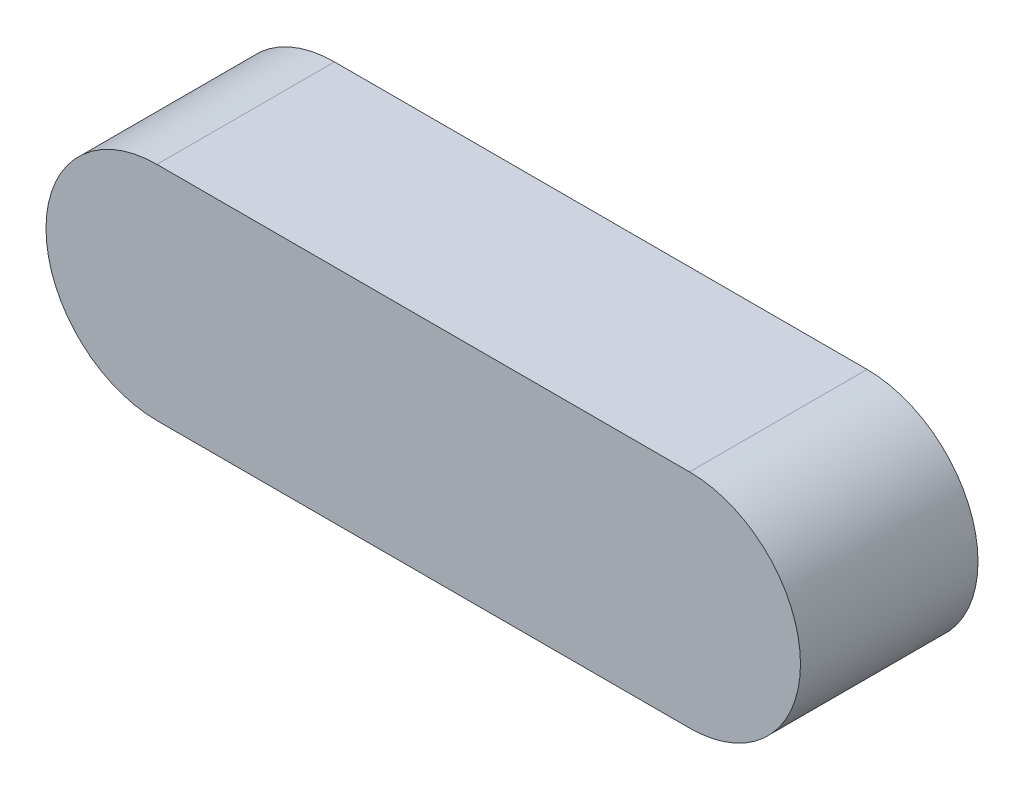
ISO-10303-21;
HEADER;
FILE_DESCRIPTION(('STEP AP214'),'2;1');
FILE_NAME('part.step','',(''),(''),'','','');
FILE_SCHEMA(('AUTOMOTIVE_DESIGN { 1 0 10303 214 1 1 1 1 }'));
ENDSEC;
DATA;
#1=APPLICATION_CONTEXT('core data for automotive mechanical design processes');
#2=APPLICATION_PROTOCOL_DEFINITION('international standard','automotive_design',2000,#1);
#3=PRODUCT_CONTEXT('',#1,'mechanical');
#4=PRODUCT('Part','Part','',(#3));
#5=PRODUCT_RELATED_PRODUCT_CATEGORY('part','',(#4));
#6=PRODUCT_DEFINITION_FORMATION('','',#4);
#7=PRODUCT_DEFINITION_CONTEXT('part definition',#1,'design');
#8=PRODUCT_DEFINITION('design','',#6,#7);
#9=PRODUCT_DEFINITION_SHAPE('','',#8);
#10=(LENGTH_UNIT() NAMED_UNIT(*) SI_UNIT(.MILLI.,.METRE.));
#11=(NAMED_UNIT(*) PLANE_ANGLE_UNIT() SI_UNIT($,.RADIAN.));
#12=(NAMED_UNIT(*) SI_UNIT($,.STERADIAN.) SOLID_ANGLE_UNIT());
#13=UNCERTAINTY_MEASURE_WITH_UNIT(LENGTH_MEASURE(1.E-05),#10,'distance_accuracy_value','');
#14=(GEOMETRIC_REPRESENTATION_CONTEXT(3) GLOBAL_UNCERTAINTY_ASSIGNED_CONTEXT((#13)) GLOBAL_UNIT_ASSIGNED_CONTEXT((#10,
#11,#12)) REPRESENTATION_CONTEXT('',''));
#15=CARTESIAN_POINT('',(0.,0.,0.));
#16=DIRECTION('',(0.,0.,1.));
#17=DIRECTION('',(1.,0.,0.));
#18=AXIS2_PLACEMENT_3D('',#15,#16,#17);
#19=CARTESIAN_POINT('',(-76.2,0.,50.8));
#20=DIRECTION('',(0.,0.,-1.));
#21=DIRECTION('',(-1.,0.,0.));
#22=AXIS2_PLACEMENT_3D('',#19,#20,#21);
#23=CYLINDRICAL_SURFACE('',#22,31.75);
#24=CARTESIAN_POINT('',(-76.2,0.,0.));
#25=DIRECTION('',(0.,0.,1.));
#26=DIRECTION('',(1.,0.,0.));
#27=AXIS2_PLACEMENT_3D('',#24,#25,#26);
#28=CIRCLE('',#27,31.75);
#29=CARTESIAN_POINT('',(-76.2,31.75,0.));
#30=VERTEX_POINT('',#29);
#31=CARTESIAN_POINT('',(-76.2,-31.75,0.));
#32=VERTEX_POINT('',#31);
#33=EDGE_CURVE('E96',#30,#32,#28,.T.);
#34=ORIENTED_EDGE('',*,*,#33,.T.);
#35=DIRECTION('',(0.,0.,-1.));
#36=VECTOR('',#35,1.);
#37=CARTESIAN_POINT('',(-76.2,-31.75,50.8));
#38=LINE('',#37,#36);
#39=CARTESIAN_POINT('',(-76.2,-31.75,50.8));
#40=VERTEX_POINT('',#39);
#41=EDGE_CURVE('E11',#40,#32,#38,.T.);
#42=ORIENTED_EDGE('',*,*,#41,.F.);
#43=CARTESIAN_POINT('',(-76.2,0.,50.8));
#44=DIRECTION('',(0.,0.,1.));
#45=DIRECTION('',(1.,0.,0.));
#46=AXIS2_PLACEMENT_3D('',#43,#44,#45);
#47=CIRCLE('',#46,31.75);
#48=CARTESIAN_POINT('',(-76.2,31.75,50.8));
#49=VERTEX_POINT('',#48);
#50=EDGE_CURVE('E84',#49,#40,#47,.T.);
#51=ORIENTED_EDGE('',*,*,#50,.F.);
#52=DIRECTION('',(0.,0.,-1.));
#53=VECTOR('',#52,1.);
#54=CARTESIAN_POINT('',(-76.2,31.75,50.8));
#55=LINE('',#54,#53);
#56=EDGE_CURVE('E92',#49,#30,#55,.T.);
#57=ORIENTED_EDGE('',*,*,#56,.T.);
#58=EDGE_LOOP('',(#34,#42,#51,#57));
#59=FACE_BOUND('',#58,.T.);
#60=ADVANCED_FACE('F33',(#59),#23,.T.);
#61=CARTESIAN_POINT('',(-76.2,-31.75,50.8));
#62=DIRECTION('',(0.,1.,0.));
#63=DIRECTION('',(-1.,0.,0.));
#64=AXIS2_PLACEMENT_3D('',#61,#62,#63);
#65=PLANE('',#64);
#66=DIRECTION('',(1.,0.,0.));
#67=VECTOR('',#66,1.);
#68=CARTESIAN_POINT('',(-76.2,-31.75,0.));
#69=LINE('',#68,#67);
#70=CARTESIAN_POINT('',(76.2,-31.75,0.));
#71=VERTEX_POINT('',#70);
#72=EDGE_CURVE('E88',#32,#71,#69,.T.);
#73=ORIENTED_EDGE('',*,*,#72,.T.);
#74=DIRECTION('',(0.,0.,-1.));
#75=VECTOR('',#74,1.);
#76=CARTESIAN_POINT('',(76.2,-31.75,50.8));
#77=LINE('',#76,#75);
#78=CARTESIAN_POINT('',(76.2,-31.75,50.8));
#79=VERTEX_POINT('',#78);
#80=EDGE_CURVE('E41',#79,#71,#77,.T.);
#81=ORIENTED_EDGE('',*,*,#80,.F.);
#82=DIRECTION('',(1.,0.,0.));
#83=VECTOR('',#82,1.);
#84=CARTESIAN_POINT('',(-76.2,-31.75,50.8));
#85=LINE('',#84,#83);
#86=EDGE_CURVE('E79',#40,#79,#85,.T.);
#87=ORIENTED_EDGE('',*,*,#86,.F.);
#88=ORIENTED_EDGE('',*,*,#41,.T.);
#89=EDGE_LOOP('',(#73,#81,#87,#88));
#90=FACE_BOUND('',#89,.T.);
#91=ADVANCED_FACE('F87',(#90),#65,.F.);
#92=CARTESIAN_POINT('',(76.2,0.,50.8));
#93=DIRECTION('',(0.,0.,-1.));
#94=DIRECTION('',(-1.,0.,0.));
#95=AXIS2_PLACEMENT_3D('',#92,#93,#94);
#96=CYLINDRICAL_SURFACE('',#95,31.75);
#97=CARTESIAN_POINT('',(76.2,0.,0.));
#98=DIRECTION('',(0.,0.,1.));
#99=DIRECTION('',(1.,0.,0.));
#100=AXIS2_PLACEMENT_3D('',#97,#98,#99);
#101=CIRCLE('',#100,31.75);
#102=CARTESIAN_POINT('',(76.2,31.7500000000001,0.));
#103=VERTEX_POINT('',#102);
#104=EDGE_CURVE('E66',#71,#103,#101,.T.);
#105=ORIENTED_EDGE('',*,*,#104,.T.);
#106=DIRECTION('',(0.,0.,-1.));
#107=VECTOR('',#106,1.);
#108=CARTESIAN_POINT('',(76.2,31.7500000000001,50.8));
#109=LINE('',#108,#107);
#110=CARTESIAN_POINT('',(76.2,31.7500000000001,50.8));
#111=VERTEX_POINT('',#110);
#112=EDGE_CURVE('E89',#111,#103,#109,.T.);
#113=ORIENTED_EDGE('',*,*,#112,.F.);
#114=CARTESIAN_POINT('',(76.2,0.,50.8));
#115=DIRECTION('',(0.,0.,1.));
#116=DIRECTION('',(1.,0.,0.));
#117=AXIS2_PLACEMENT_3D('',#114,#115,#116);
#118=CIRCLE('',#117,31.75);
#119=EDGE_CURVE('E82',#79,#111,#118,.T.);
#120=ORIENTED_EDGE('',*,*,#119,.F.);
#121=ORIENTED_EDGE('',*,*,#80,.T.);
#122=EDGE_LOOP('',(#105,#113,#120,#121));
#123=FACE_BOUND('',#122,.T.);
#124=ADVANCED_FACE('F90',(#123),#96,.T.);
#125=CARTESIAN_POINT('',(-76.2,31.75,50.8));
#126=DIRECTION('',(0.,-1.,0.));
#127=DIRECTION('',(1.,0.,0.));
#128=AXIS2_PLACEMENT_3D('',#125,#126,#127);
#129=PLANE('',#128);
#130=DIRECTION('',(-1.,0.,0.));
#131=VECTOR('',#130,1.);
#132=CARTESIAN_POINT('',(-76.2,31.75,0.));
#133=LINE('',#132,#131);
#134=EDGE_CURVE('E72',#103,#30,#133,.T.);
#135=ORIENTED_EDGE('',*,*,#134,.T.);
#136=ORIENTED_EDGE('',*,*,#56,.F.);
#137=DIRECTION('',(-1.,0.,0.));
#138=VECTOR('',#137,1.);
#139=CARTESIAN_POINT('',(-76.2,31.75,50.8));
#140=LINE('',#139,#138);
#141=EDGE_CURVE('E49',#111,#49,#140,.T.);
#142=ORIENTED_EDGE('',*,*,#141,.F.);
#143=ORIENTED_EDGE('',*,*,#112,.T.);
#144=EDGE_LOOP('',(#135,#136,#142,#143));
#145=FACE_BOUND('',#144,.T.);
#146=ADVANCED_FACE('F103',(#145),#129,.F.);
#147=CARTESIAN_POINT('',(-76.2,0.,50.8));
#148=DIRECTION('',(0.,0.,1.));
#149=DIRECTION('',(1.,0.,0.));
#150=AXIS2_PLACEMENT_3D('',#147,#148,#149);
#151=PLANE('',#150);
#152=ORIENTED_EDGE('',*,*,#50,.T.);
#153=ORIENTED_EDGE('',*,*,#86,.T.);
#154=ORIENTED_EDGE('',*,*,#119,.T.);
#155=ORIENTED_EDGE('',*,*,#141,.T.);
#156=EDGE_LOOP('',(#152,#153,#154,#155));
#157=FACE_BOUND('',#156,.T.);
#158=ADVANCED_FACE('F80',(#157),#151,.T.);
#159=CARTESIAN_POINT('',(-76.2,0.,0.));
#160=DIRECTION('',(0.,0.,1.));
#161=DIRECTION('',(1.,0.,0.));
#162=AXIS2_PLACEMENT_3D('',#159,#160,#161);
#163=PLANE('',#162);
#164=ORIENTED_EDGE('',*,*,#33,.F.);
#165=ORIENTED_EDGE('',*,*,#134,.F.);
#166=ORIENTED_EDGE('',*,*,#104,.F.);
#167=ORIENTED_EDGE('',*,*,#72,.F.);
#168=EDGE_LOOP('',(#164,#165,#166,#167));
#169=FACE_BOUND('',#168,.T.);
#170=ADVANCED_FACE('F106',(#169),#163,.F.);
#171=CLOSED_SHELL('',(#60,#91,#124,#146,#158,#170));
#172=MANIFOLD_SOLID_BREP('B2',#171);
#173=ADVANCED_BREP_SHAPE_REPRESENTATION('',(#18,#172),#14);
#174=SHAPE_DEFINITION_REPRESENTATION(#9,#173);
ENDSEC;
END-ISO-10303-21;
